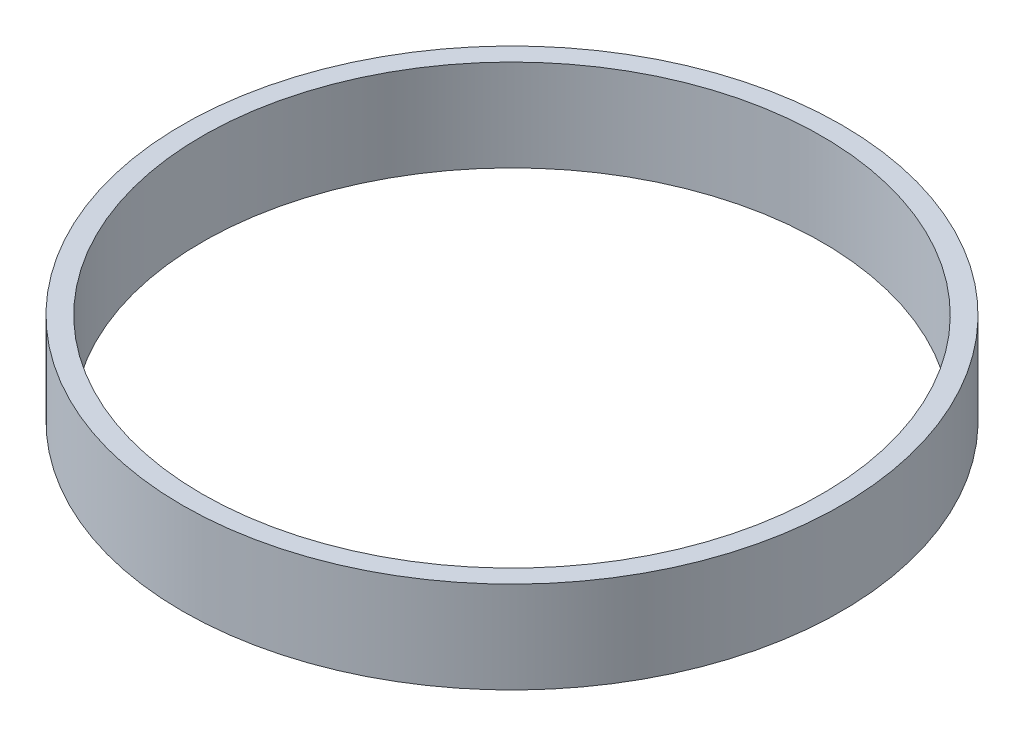
ISO-10303-21;
HEADER;
FILE_DESCRIPTION(('STEP AP214'),'2;1');
FILE_NAME('part.step','',(''),(''),'','','');
FILE_SCHEMA(('AUTOMOTIVE_DESIGN { 1 0 10303 214 1 1 1 1 }'));
ENDSEC;
DATA;
#1=APPLICATION_CONTEXT('core data for automotive mechanical design processes');
#2=APPLICATION_PROTOCOL_DEFINITION('international standard','automotive_design',2000,#1);
#3=PRODUCT_CONTEXT('',#1,'mechanical');
#4=PRODUCT('Part','Part','',(#3));
#5=PRODUCT_RELATED_PRODUCT_CATEGORY('part','',(#4));
#6=PRODUCT_DEFINITION_FORMATION('','',#4);
#7=PRODUCT_DEFINITION_CONTEXT('part definition',#1,'design');
#8=PRODUCT_DEFINITION('design','',#6,#7);
#9=PRODUCT_DEFINITION_SHAPE('','',#8);
#10=(LENGTH_UNIT() NAMED_UNIT(*) SI_UNIT(.MILLI.,.METRE.));
#11=(NAMED_UNIT(*) PLANE_ANGLE_UNIT() SI_UNIT($,.RADIAN.));
#12=(NAMED_UNIT(*) SI_UNIT($,.STERADIAN.) SOLID_ANGLE_UNIT());
#13=UNCERTAINTY_MEASURE_WITH_UNIT(LENGTH_MEASURE(1.E-05),#10,'distance_accuracy_value','');
#14=(GEOMETRIC_REPRESENTATION_CONTEXT(3) GLOBAL_UNCERTAINTY_ASSIGNED_CONTEXT((#13)) GLOBAL_UNIT_ASSIGNED_CONTEXT((#10,
#11,#12)) REPRESENTATION_CONTEXT('',''));
#15=CARTESIAN_POINT('',(0.,0.,0.));
#16=DIRECTION('',(0.,0.,1.));
#17=DIRECTION('',(1.,0.,0.));
#18=AXIS2_PLACEMENT_3D('',#15,#16,#17);
#19=CARTESIAN_POINT('',(0.,22.225,0.));
#20=DIRECTION('',(0.,1.,0.));
#21=DIRECTION('',(0.,0.,1.));
#22=AXIS2_PLACEMENT_3D('',#19,#20,#21);
#23=PLANE('',#22);
#24=CARTESIAN_POINT('',(0.,22.225,0.));
#25=DIRECTION('',(0.,1.,0.));
#26=DIRECTION('',(0.,0.,1.));
#27=AXIS2_PLACEMENT_3D('',#24,#25,#26);
#28=CIRCLE('',#27,79.883);
#29=CARTESIAN_POINT('',(0.,22.225,79.883));
#30=VERTEX_POINT('',#29);
#31=EDGE_CURVE('E10',#30,#30,#28,.T.);
#32=ORIENTED_EDGE('',*,*,#31,.T.);
#33=EDGE_LOOP('',(#32));
#34=FACE_BOUND('',#33,.T.);
#35=CARTESIAN_POINT('',(0.,22.225,0.));
#36=DIRECTION('',(0.,1.,0.));
#37=DIRECTION('',(0.,0.,1.));
#38=AXIS2_PLACEMENT_3D('',#35,#36,#37);
#39=CIRCLE('',#38,75.1205);
#40=CARTESIAN_POINT('',(0.,22.225,75.1205));
#41=VERTEX_POINT('',#40);
#42=EDGE_CURVE('E41',#41,#41,#39,.T.);
#43=ORIENTED_EDGE('',*,*,#42,.F.);
#44=EDGE_LOOP('',(#43));
#45=FACE_BOUND('',#44,.T.);
#46=ADVANCED_FACE('F30',(#34,#45),#23,.T.);
#47=CARTESIAN_POINT('',(0.,0.,0.));
#48=DIRECTION('',(0.,1.,0.));
#49=DIRECTION('',(0.,0.,1.));
#50=AXIS2_PLACEMENT_3D('',#47,#48,#49);
#51=PLANE('',#50);
#52=CARTESIAN_POINT('',(0.,0.,0.));
#53=DIRECTION('',(0.,1.,0.));
#54=DIRECTION('',(0.,0.,1.));
#55=AXIS2_PLACEMENT_3D('',#52,#53,#54);
#56=CIRCLE('',#55,79.883);
#57=CARTESIAN_POINT('',(0.,0.,79.883));
#58=VERTEX_POINT('',#57);
#59=EDGE_CURVE('E34',#58,#58,#56,.T.);
#60=ORIENTED_EDGE('',*,*,#59,.F.);
#61=EDGE_LOOP('',(#60));
#62=FACE_BOUND('',#61,.T.);
#63=CARTESIAN_POINT('',(0.,0.,0.));
#64=DIRECTION('',(0.,1.,0.));
#65=DIRECTION('',(0.,0.,1.));
#66=AXIS2_PLACEMENT_3D('',#63,#64,#65);
#67=CIRCLE('',#66,75.1205);
#68=CARTESIAN_POINT('',(0.,0.,75.1205));
#69=VERTEX_POINT('',#68);
#70=EDGE_CURVE('E43',#69,#69,#67,.T.);
#71=ORIENTED_EDGE('',*,*,#70,.T.);
#72=EDGE_LOOP('',(#71));
#73=FACE_BOUND('',#72,.T.);
#74=ADVANCED_FACE('F53',(#62,#73),#51,.F.);
#75=CARTESIAN_POINT('',(0.,22.225,0.));
#76=DIRECTION('',(0.,-1.,0.));
#77=DIRECTION('',(0.,0.,-1.));
#78=AXIS2_PLACEMENT_3D('',#75,#76,#77);
#79=CYLINDRICAL_SURFACE('',#78,79.883);
#80=ORIENTED_EDGE('',*,*,#31,.F.);
#81=EDGE_LOOP('',(#80));
#82=FACE_BOUND('',#81,.T.);
#83=ORIENTED_EDGE('',*,*,#59,.T.);
#84=EDGE_LOOP('',(#83));
#85=FACE_BOUND('',#84,.T.);
#86=ADVANCED_FACE('F32',(#82,#85),#79,.T.);
#87=CARTESIAN_POINT('',(0.,22.225,0.));
#88=DIRECTION('',(0.,-1.,0.));
#89=DIRECTION('',(0.,0.,-1.));
#90=AXIS2_PLACEMENT_3D('',#87,#88,#89);
#91=CYLINDRICAL_SURFACE('',#90,75.1205);
#92=ORIENTED_EDGE('',*,*,#42,.T.);
#93=EDGE_LOOP('',(#92));
#94=FACE_BOUND('',#93,.T.);
#95=ORIENTED_EDGE('',*,*,#70,.F.);
#96=EDGE_LOOP('',(#95));
#97=FACE_BOUND('',#96,.T.);
#98=ADVANCED_FACE('F49',(#94,#97),#91,.F.);
#99=CLOSED_SHELL('',(#46,#74,#86,#98));
#100=MANIFOLD_SOLID_BREP('B2',#99);
#101=ADVANCED_BREP_SHAPE_REPRESENTATION('',(#18,#100),#14);
#102=SHAPE_DEFINITION_REPRESENTATION(#9,#101);
ENDSEC;
END-ISO-10303-21;
